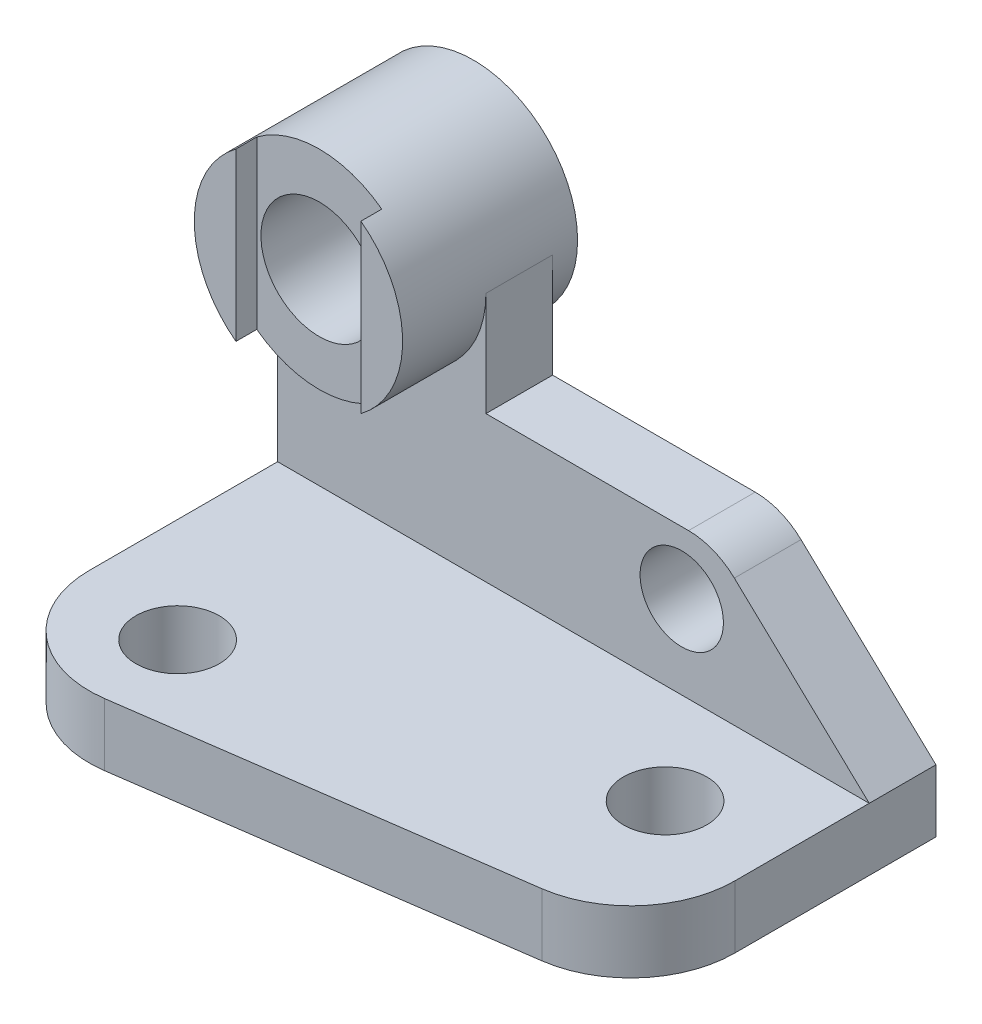
ISO-10303-21;
HEADER;
FILE_DESCRIPTION(('STEP AP214'),'2;1');
FILE_NAME('part.step','',(''),(''),'','','');
FILE_SCHEMA(('AUTOMOTIVE_DESIGN { 1 0 10303 214 1 1 1 1 }'));
ENDSEC;
DATA;
#1=APPLICATION_CONTEXT('core data for automotive mechanical design processes');
#2=APPLICATION_PROTOCOL_DEFINITION('international standard','automotive_design',2000,#1);
#3=PRODUCT_CONTEXT('',#1,'mechanical');
#4=PRODUCT('Part','Part','',(#3));
#5=PRODUCT_RELATED_PRODUCT_CATEGORY('part','',(#4));
#6=PRODUCT_DEFINITION_FORMATION('','',#4);
#7=PRODUCT_DEFINITION_CONTEXT('part definition',#1,'design');
#8=PRODUCT_DEFINITION('design','',#6,#7);
#9=PRODUCT_DEFINITION_SHAPE('','',#8);
#10=(LENGTH_UNIT() NAMED_UNIT(*) SI_UNIT(.MILLI.,.METRE.));
#11=(NAMED_UNIT(*) PLANE_ANGLE_UNIT() SI_UNIT($,.RADIAN.));
#12=(NAMED_UNIT(*) SI_UNIT($,.STERADIAN.) SOLID_ANGLE_UNIT());
#13=UNCERTAINTY_MEASURE_WITH_UNIT(LENGTH_MEASURE(1.E-05),#10,'distance_accuracy_value','');
#14=(GEOMETRIC_REPRESENTATION_CONTEXT(3) GLOBAL_UNCERTAINTY_ASSIGNED_CONTEXT((#13)) GLOBAL_UNIT_ASSIGNED_CONTEXT((#10,
#11,#12)) REPRESENTATION_CONTEXT('',''));
#15=CARTESIAN_POINT('',(0.,0.,0.));
#16=DIRECTION('',(0.,0.,1.));
#17=DIRECTION('',(1.,0.,0.));
#18=AXIS2_PLACEMENT_3D('',#15,#16,#17);
#19=CARTESIAN_POINT('',(0.,0.,-30.2957443941805));
#20=DIRECTION('',(0.,0.,1.));
#21=DIRECTION('',(1.,0.,0.));
#22=AXIS2_PLACEMENT_3D('',#19,#20,#21);
#23=PLANE('',#22);
#24=CARTESIAN_POINT('',(-35.1278678781771,75.,-30.2957443941804));
#25=DIRECTION('',(0.,0.,1.));
#26=DIRECTION('',(1.,0.,0.));
#27=AXIS2_PLACEMENT_3D('',#24,#25,#26);
#28=CIRCLE('',#27,25.);
#29=CARTESIAN_POINT('',(-50.1278678781771,95.,-30.2957443941804));
#30=VERTEX_POINT('',#29);
#31=CARTESIAN_POINT('',(-50.1278678781771,55.,-30.2957443941805));
#32=VERTEX_POINT('',#31);
#33=EDGE_CURVE('E175',#30,#32,#28,.T.);
#34=ORIENTED_EDGE('',*,*,#33,.T.);
#35=DIRECTION('',(0.,-1.,0.));
#36=VECTOR('',#35,1.);
#37=CARTESIAN_POINT('',(-50.1278678781771,95.,-30.2957443941805));
#38=LINE('',#37,#36);
#39=EDGE_CURVE('E168',#30,#32,#38,.T.);
#40=ORIENTED_EDGE('',*,*,#39,.F.);
#41=EDGE_LOOP('',(#34,#40));
#42=FACE_BOUND('',#41,.T.);
#43=ADVANCED_FACE('F40',(#42),#23,.T.);
#44=CARTESIAN_POINT('',(0.,15.,0.));
#45=DIRECTION('',(0.,1.,0.));
#46=DIRECTION('',(0.,0.,1.));
#47=AXIS2_PLACEMENT_3D('',#44,#45,#46);
#48=PLANE('',#47);
#49=CARTESIAN_POINT('',(-35.1278678781771,15.,-1.29574439418016));
#50=DIRECTION('',(0.,1.,0.));
#51=DIRECTION('',(0.,0.,1.));
#52=AXIS2_PLACEMENT_3D('',#49,#50,#51);
#53=CIRCLE('',#52,10.);
#54=CARTESIAN_POINT('',(-35.1278678781771,15.,8.70425560581984));
#55=VERTEX_POINT('',#54);
#56=EDGE_CURVE('E389',#55,#55,#53,.T.);
#57=ORIENTED_EDGE('',*,*,#56,.F.);
#58=EDGE_LOOP('',(#57));
#59=FACE_BOUND('',#58,.T.);
#60=CARTESIAN_POINT('',(56.8721321218229,15.,-26.2957443941802));
#61=DIRECTION('',(0.,1.,0.));
#62=DIRECTION('',(0.,0.,1.));
#63=AXIS2_PLACEMENT_3D('',#60,#61,#62);
#64=CIRCLE('',#63,10.);
#65=CARTESIAN_POINT('',(56.8721321218229,15.,-16.2957443941802));
#66=VERTEX_POINT('',#65);
#67=EDGE_CURVE('E465',#66,#66,#64,.T.);
#68=ORIENTED_EDGE('',*,*,#67,.F.);
#69=EDGE_LOOP('',(#68));
#70=FACE_BOUND('',#69,.T.);
#71=DIRECTION('',(0.,0.,-1.));
#72=VECTOR('',#71,1.);
#73=CARTESIAN_POINT('',(81.8721321218229,15.,-66.2957443941802));
#74=LINE('',#73,#72);
#75=CARTESIAN_POINT('',(81.8721321218229,15.,-18.0213666057905));
#76=VERTEX_POINT('',#75);
#77=CARTESIAN_POINT('',(81.8721321218229,15.,-50.2957443941802));
#78=VERTEX_POINT('',#77);
#79=EDGE_CURVE('E373',#76,#78,#74,.T.);
#80=ORIENTED_EDGE('',*,*,#79,.T.);
#81=DIRECTION('',(-1.,0.,0.));
#82=VECTOR('',#81,1.);
#83=CARTESIAN_POINT('',(-60.1278678781771,15.,-50.2957443941802));
#84=LINE('',#83,#82);
#85=CARTESIAN_POINT('',(-60.1278678781771,15.,-50.2957443941802));
#86=VERTEX_POINT('',#85);
#87=EDGE_CURVE('E418',#78,#86,#84,.T.);
#88=ORIENTED_EDGE('',*,*,#87,.T.);
#89=DIRECTION('',(0.,0.,1.));
#90=VECTOR('',#89,1.);
#91=CARTESIAN_POINT('',(-60.1278678781771,15.,-66.2957443941802));
#92=LINE('',#91,#90);
#93=CARTESIAN_POINT('',(-60.1278678781771,15.,-5.06362012691729));
#94=VERTEX_POINT('',#93);
#95=EDGE_CURVE('E379',#86,#94,#92,.T.);
#96=ORIENTED_EDGE('',*,*,#95,.T.);
#97=CARTESIAN_POINT('',(-35.1278678781771,15.,-5.06362012691728));
#98=DIRECTION('',(0.,1.,0.));
#99=DIRECTION('',(0.,0.,1.));
#100=AXIS2_PLACEMENT_3D('',#97,#98,#99);
#101=CIRCLE('',#100,25.);
#102=CARTESIAN_POINT('',(-31.6411548320298,15.,19.6920425007287));
#103=VERTEX_POINT('',#102);
#104=EDGE_CURVE('E358',#94,#103,#101,.T.);
#105=ORIENTED_EDGE('',*,*,#104,.T.);
#106=DIRECTION('',(0.990226505105838,0.,-0.139468521845893));
#107=VECTOR('',#106,1.);
#108=CARTESIAN_POINT('',(-60.1278678781771,15.,23.7042556058198));
#109=LINE('',#108,#107);
#110=CARTESIAN_POINT('',(60.3588451679702,15.,6.73429602185544));
#111=VERTEX_POINT('',#110);
#112=EDGE_CURVE('E378',#103,#111,#109,.T.);
#113=ORIENTED_EDGE('',*,*,#112,.T.);
#114=CARTESIAN_POINT('',(56.8721321218229,15.,-18.0213666057905));
#115=DIRECTION('',(0.,1.,0.));
#116=DIRECTION('',(0.,0.,1.));
#117=AXIS2_PLACEMENT_3D('',#114,#115,#116);
#118=CIRCLE('',#117,25.);
#119=EDGE_CURVE('E365',#111,#76,#118,.T.);
#120=ORIENTED_EDGE('',*,*,#119,.T.);
#121=EDGE_LOOP('',(#80,#88,#96,#105,#113,#120));
#122=FACE_BOUND('',#121,.T.);
#123=ADVANCED_FACE('F276',(#59,#70,#122),#48,.T.);
#124=CARTESIAN_POINT('',(0.,0.,0.));
#125=DIRECTION('',(0.,1.,0.));
#126=DIRECTION('',(0.,0.,1.));
#127=AXIS2_PLACEMENT_3D('',#124,#125,#126);
#128=PLANE('',#127);
#129=DIRECTION('',(0.,0.,-1.));
#130=VECTOR('',#129,1.);
#131=CARTESIAN_POINT('',(81.8721321218229,0.,-66.2957443941802));
#132=LINE('',#131,#130);
#133=CARTESIAN_POINT('',(81.8721321218229,0.,-18.0213666057905));
#134=VERTEX_POINT('',#133);
#135=CARTESIAN_POINT('',(81.8721321218229,0.,-66.2957443941802));
#136=VERTEX_POINT('',#135);
#137=EDGE_CURVE('E392',#134,#136,#132,.T.);
#138=ORIENTED_EDGE('',*,*,#137,.F.);
#139=CARTESIAN_POINT('',(56.8721321218229,0.,-18.0213666057905));
#140=DIRECTION('',(0.,1.,0.));
#141=DIRECTION('',(0.,0.,1.));
#142=AXIS2_PLACEMENT_3D('',#139,#140,#141);
#143=CIRCLE('',#142,25.);
#144=CARTESIAN_POINT('',(60.3588451679702,0.,6.73429602185544));
#145=VERTEX_POINT('',#144);
#146=EDGE_CURVE('E402',#134,#145,#143,.F.);
#147=ORIENTED_EDGE('',*,*,#146,.T.);
#148=DIRECTION('',(0.990226505105838,0.,-0.139468521845893));
#149=VECTOR('',#148,1.);
#150=CARTESIAN_POINT('',(-60.1278678781771,0.,23.7042556058198));
#151=LINE('',#150,#149);
#152=CARTESIAN_POINT('',(-31.6411548320298,0.,19.6920425007287));
#153=VERTEX_POINT('',#152);
#154=EDGE_CURVE('E388',#153,#145,#151,.T.);
#155=ORIENTED_EDGE('',*,*,#154,.F.);
#156=CARTESIAN_POINT('',(-35.1278678781771,0.,-5.06362012691728));
#157=DIRECTION('',(0.,1.,0.));
#158=DIRECTION('',(0.,0.,1.));
#159=AXIS2_PLACEMENT_3D('',#156,#157,#158);
#160=CIRCLE('',#159,25.);
#161=CARTESIAN_POINT('',(-60.1278678781771,0.,-5.06362012691729));
#162=VERTEX_POINT('',#161);
#163=EDGE_CURVE('E399',#153,#162,#160,.F.);
#164=ORIENTED_EDGE('',*,*,#163,.T.);
#165=DIRECTION('',(0.,0.,1.));
#166=VECTOR('',#165,1.);
#167=CARTESIAN_POINT('',(-60.1278678781771,0.,-66.2957443941802));
#168=LINE('',#167,#166);
#169=CARTESIAN_POINT('',(-60.1278678781771,0.,-66.2957443941802));
#170=VERTEX_POINT('',#169);
#171=EDGE_CURVE('E385',#170,#162,#168,.T.);
#172=ORIENTED_EDGE('',*,*,#171,.F.);
#173=DIRECTION('',(-1.,0.,0.));
#174=VECTOR('',#173,1.);
#175=CARTESIAN_POINT('',(-60.1278678781771,0.,-66.2957443941802));
#176=LINE('',#175,#174);
#177=EDGE_CURVE('E394',#136,#170,#176,.T.);
#178=ORIENTED_EDGE('',*,*,#177,.F.);
#179=EDGE_LOOP('',(#138,#147,#155,#164,#172,#178));
#180=FACE_BOUND('',#179,.T.);
#181=CARTESIAN_POINT('',(-35.1278678781771,0.,-1.29574439418016));
#182=DIRECTION('',(0.,1.,0.));
#183=DIRECTION('',(0.,0.,1.));
#184=AXIS2_PLACEMENT_3D('',#181,#182,#183);
#185=CIRCLE('',#184,10.);
#186=CARTESIAN_POINT('',(-35.1278678781771,0.,8.70425560581984));
#187=VERTEX_POINT('',#186);
#188=EDGE_CURVE('E468',#187,#187,#185,.T.);
#189=ORIENTED_EDGE('',*,*,#188,.T.);
#190=EDGE_LOOP('',(#189));
#191=FACE_BOUND('',#190,.T.);
#192=CARTESIAN_POINT('',(56.8721321218229,0.,-26.2957443941802));
#193=DIRECTION('',(0.,1.,0.));
#194=DIRECTION('',(0.,0.,1.));
#195=AXIS2_PLACEMENT_3D('',#192,#193,#194);
#196=CIRCLE('',#195,10.);
#197=CARTESIAN_POINT('',(56.8721321218229,0.,-16.2957443941802));
#198=VERTEX_POINT('',#197);
#199=EDGE_CURVE('E239',#198,#198,#196,.T.);
#200=ORIENTED_EDGE('',*,*,#199,.T.);
#201=EDGE_LOOP('',(#200));
#202=FACE_BOUND('',#201,.T.);
#203=ADVANCED_FACE('F281',(#180,#191,#202),#128,.F.);
#204=CARTESIAN_POINT('',(-60.1278678781771,15.,-66.2957443941802));
#205=DIRECTION('',(1.,0.,0.));
#206=DIRECTION('',(0.,0.,-1.));
#207=AXIS2_PLACEMENT_3D('',#204,#205,#206);
#208=PLANE('',#207);
#209=ORIENTED_EDGE('',*,*,#171,.T.);
#210=DIRECTION('',(0.,-1.,0.));
#211=VECTOR('',#210,1.);
#212=CARTESIAN_POINT('',(-60.1278678781771,15.,-5.06362012691728));
#213=LINE('',#212,#211);
#214=EDGE_CURVE('E247',#162,#94,#213,.F.);
#215=ORIENTED_EDGE('',*,*,#214,.T.);
#216=ORIENTED_EDGE('',*,*,#95,.F.);
#217=DIRECTION('',(0.,1.,0.));
#218=VECTOR('',#217,1.);
#219=CARTESIAN_POINT('',(-60.1278678781771,15.,-50.2957443941802));
#220=LINE('',#219,#218);
#221=CARTESIAN_POINT('',(-60.1278678781771,75.,-50.2957443941804));
#222=VERTEX_POINT('',#221);
#223=EDGE_CURVE('E434',#86,#222,#220,.T.);
#224=ORIENTED_EDGE('',*,*,#223,.T.);
#225=DIRECTION('',(0.,0.,1.));
#226=VECTOR('',#225,1.);
#227=CARTESIAN_POINT('',(-60.1278678781771,75.,-66.2957443941802));
#228=LINE('',#227,#226);
#229=CARTESIAN_POINT('',(-60.1278678781771,75.,-66.2957443941802));
#230=VERTEX_POINT('',#229);
#231=EDGE_CURVE('E436',#230,#222,#228,.T.);
#232=ORIENTED_EDGE('',*,*,#231,.F.);
#233=DIRECTION('',(0.,-1.,0.));
#234=VECTOR('',#233,1.);
#235=CARTESIAN_POINT('',(-60.1278678781771,15.,-66.2957443941802));
#236=LINE('',#235,#234);
#237=EDGE_CURVE('E377',#230,#170,#236,.T.);
#238=ORIENTED_EDGE('',*,*,#237,.T.);
#239=EDGE_LOOP('',(#209,#215,#216,#224,#232,#238));
#240=FACE_BOUND('',#239,.T.);
#241=ADVANCED_FACE('F333',(#240),#208,.F.);
#242=CARTESIAN_POINT('',(-60.1278678781771,15.,23.7042556058198));
#243=DIRECTION('',(-0.139468521845893,0.,-0.990226505105838));
#244=DIRECTION('',(-0.990226505105838,0.,0.139468521845893));
#245=AXIS2_PLACEMENT_3D('',#242,#243,#244);
#246=PLANE('',#245);
#247=ORIENTED_EDGE('',*,*,#154,.T.);
#248=DIRECTION('',(0.,-1.,0.));
#249=VECTOR('',#248,1.);
#250=CARTESIAN_POINT('',(60.3588451679702,15.,6.73429602185543));
#251=LINE('',#250,#249);
#252=EDGE_CURVE('E366',#145,#111,#251,.F.);
#253=ORIENTED_EDGE('',*,*,#252,.T.);
#254=ORIENTED_EDGE('',*,*,#112,.F.);
#255=DIRECTION('',(0.,-1.,0.));
#256=VECTOR('',#255,1.);
#257=CARTESIAN_POINT('',(-31.6411548320298,15.,19.6920425007287));
#258=LINE('',#257,#256);
#259=EDGE_CURVE('E361',#103,#153,#258,.T.);
#260=ORIENTED_EDGE('',*,*,#259,.T.);
#261=EDGE_LOOP('',(#247,#253,#254,#260));
#262=FACE_BOUND('',#261,.T.);
#263=ADVANCED_FACE('F341',(#262),#246,.F.);
#264=CARTESIAN_POINT('',(81.8721321218229,15.,-66.2957443941802));
#265=DIRECTION('',(-1.,0.,0.));
#266=DIRECTION('',(0.,0.,1.));
#267=AXIS2_PLACEMENT_3D('',#264,#265,#266);
#268=PLANE('',#267);
#269=ORIENTED_EDGE('',*,*,#79,.F.);
#270=DIRECTION('',(0.,-1.,0.));
#271=VECTOR('',#270,1.);
#272=CARTESIAN_POINT('',(81.8721321218229,15.,-18.0213666057905));
#273=LINE('',#272,#271);
#274=EDGE_CURVE('E396',#76,#134,#273,.T.);
#275=ORIENTED_EDGE('',*,*,#274,.T.);
#276=ORIENTED_EDGE('',*,*,#137,.T.);
#277=DIRECTION('',(0.,-1.,0.));
#278=VECTOR('',#277,1.);
#279=CARTESIAN_POINT('',(81.8721321218229,15.,-66.2957443941802));
#280=LINE('',#279,#278);
#281=CARTESIAN_POINT('',(81.8721321218229,15.,-66.2957443941802));
#282=VERTEX_POINT('',#281);
#283=EDGE_CURVE('E400',#282,#136,#280,.T.);
#284=ORIENTED_EDGE('',*,*,#283,.F.);
#285=DIRECTION('',(0.,0.,1.));
#286=VECTOR('',#285,1.);
#287=CARTESIAN_POINT('',(81.8721321218229,15.,-66.2957443941802));
#288=LINE('',#287,#286);
#289=EDGE_CURVE('E233',#282,#78,#288,.T.);
#290=ORIENTED_EDGE('',*,*,#289,.T.);
#291=EDGE_LOOP('',(#269,#275,#276,#284,#290));
#292=FACE_BOUND('',#291,.T.);
#293=ADVANCED_FACE('F337',(#292),#268,.F.);
#294=CARTESIAN_POINT('',(-60.1278678781771,15.,-66.2957443941802));
#295=DIRECTION('',(0.,0.,1.));
#296=DIRECTION('',(1.,0.,0.));
#297=AXIS2_PLACEMENT_3D('',#294,#295,#296);
#298=PLANE('',#297);
#299=CARTESIAN_POINT('',(-35.1278678781771,75.,-66.2957443941802));
#300=DIRECTION('',(0.,0.,1.));
#301=DIRECTION('',(1.,0.,0.));
#302=AXIS2_PLACEMENT_3D('',#299,#300,#301);
#303=CIRCLE('',#302,25.);
#304=CARTESIAN_POINT('',(-10.1278678781771,75.,-66.2957443941802));
#305=VERTEX_POINT('',#304);
#306=EDGE_CURVE('E212',#305,#230,#303,.F.);
#307=ORIENTED_EDGE('',*,*,#306,.F.);
#308=DIRECTION('',(0.,-1.,0.));
#309=VECTOR('',#308,1.);
#310=CARTESIAN_POINT('',(-10.1278678781771,75.,-66.2957443941802));
#311=LINE('',#310,#309);
#312=CARTESIAN_POINT('',(-10.1278678781771,50.,-66.2957443941802));
#313=VERTEX_POINT('',#312);
#314=EDGE_CURVE('E446',#305,#313,#311,.T.);
#315=ORIENTED_EDGE('',*,*,#314,.T.);
#316=DIRECTION('',(1.,0.,0.));
#317=VECTOR('',#316,1.);
#318=CARTESIAN_POINT('',(-10.1278678781771,50.,-66.2957443941802));
#319=LINE('',#318,#317);
#320=CARTESIAN_POINT('',(38.5035258073144,50.,-66.2957443941802));
#321=VERTEX_POINT('',#320);
#322=EDGE_CURVE('E225',#313,#321,#319,.T.);
#323=ORIENTED_EDGE('',*,*,#322,.T.);
#324=CARTESIAN_POINT('',(38.5035258073144,34.,-66.2957443941802));
#325=DIRECTION('',(0.,0.,1.));
#326=DIRECTION('',(1.,0.,0.));
#327=AXIS2_PLACEMENT_3D('',#324,#325,#326);
#328=CIRCLE('',#327,16.);
#329=CARTESIAN_POINT('',(49.4987234693317,45.6234946712754,-66.2957443941802));
#330=VERTEX_POINT('',#329);
#331=EDGE_CURVE('E12',#321,#330,#328,.F.);
#332=ORIENTED_EDGE('',*,*,#331,.T.);
#333=DIRECTION('',(0.726468416954716,-0.687199853876083,0.));
#334=VECTOR('',#333,1.);
#335=CARTESIAN_POINT('',(44.8721321218229,50.,-66.2957443941802));
#336=LINE('',#335,#334);
#337=EDGE_CURVE('E236',#330,#282,#336,.T.);
#338=ORIENTED_EDGE('',*,*,#337,.T.);
#339=ORIENTED_EDGE('',*,*,#283,.T.);
#340=ORIENTED_EDGE('',*,*,#177,.T.);
#341=ORIENTED_EDGE('',*,*,#237,.F.);
#342=EDGE_LOOP('',(#307,#315,#323,#332,#338,#339,#340,#341));
#343=FACE_BOUND('',#342,.T.);
#344=CARTESIAN_POINT('',(36.8721321218229,35.,-66.2957443941802));
#345=DIRECTION('',(0.,0.,1.));
#346=DIRECTION('',(1.,0.,0.));
#347=AXIS2_PLACEMENT_3D('',#344,#345,#346);
#348=CIRCLE('',#347,10.);
#349=CARTESIAN_POINT('',(46.8721321218229,35.,-66.2957443941802));
#350=VERTEX_POINT('',#349);
#351=EDGE_CURVE('E216',#350,#350,#348,.T.);
#352=ORIENTED_EDGE('',*,*,#351,.T.);
#353=EDGE_LOOP('',(#352));
#354=FACE_BOUND('',#353,.T.);
#355=ADVANCED_FACE('F328',(#343,#354),#298,.F.);
#356=CARTESIAN_POINT('',(-35.1278678781771,15.,-1.29574439418016));
#357=DIRECTION('',(0.,-1.,0.));
#358=DIRECTION('',(0.,0.,-1.));
#359=AXIS2_PLACEMENT_3D('',#356,#357,#358);
#360=CYLINDRICAL_SURFACE('',#359,10.);
#361=ORIENTED_EDGE('',*,*,#56,.T.);
#362=EDGE_LOOP('',(#361));
#363=FACE_BOUND('',#362,.T.);
#364=ORIENTED_EDGE('',*,*,#188,.F.);
#365=EDGE_LOOP('',(#364));
#366=FACE_BOUND('',#365,.T.);
#367=ADVANCED_FACE('F325',(#363,#366),#360,.F.);
#368=CARTESIAN_POINT('',(56.8721321218229,15.,-26.2957443941802));
#369=DIRECTION('',(0.,-1.,0.));
#370=DIRECTION('',(0.,0.,-1.));
#371=AXIS2_PLACEMENT_3D('',#368,#369,#370);
#372=CYLINDRICAL_SURFACE('',#371,10.);
#373=ORIENTED_EDGE('',*,*,#67,.T.);
#374=EDGE_LOOP('',(#373));
#375=FACE_BOUND('',#374,.T.);
#376=ORIENTED_EDGE('',*,*,#199,.F.);
#377=EDGE_LOOP('',(#376));
#378=FACE_BOUND('',#377,.T.);
#379=ADVANCED_FACE('F321',(#375,#378),#372,.F.);
#380=CARTESIAN_POINT('',(56.8721321218229,15.,-18.0213666057905));
#381=DIRECTION('',(0.,-1.,0.));
#382=DIRECTION('',(0.,0.,-1.));
#383=AXIS2_PLACEMENT_3D('',#380,#381,#382);
#384=CYLINDRICAL_SURFACE('',#383,25.);
#385=ORIENTED_EDGE('',*,*,#119,.F.);
#386=ORIENTED_EDGE('',*,*,#252,.F.);
#387=ORIENTED_EDGE('',*,*,#146,.F.);
#388=ORIENTED_EDGE('',*,*,#274,.F.);
#389=EDGE_LOOP('',(#385,#386,#387,#388));
#390=FACE_BOUND('',#389,.T.);
#391=ADVANCED_FACE('F324',(#390),#384,.T.);
#392=CARTESIAN_POINT('',(-35.1278678781771,15.,-5.06362012691728));
#393=DIRECTION('',(0.,-1.,0.));
#394=DIRECTION('',(0.,0.,-1.));
#395=AXIS2_PLACEMENT_3D('',#392,#393,#394);
#396=CYLINDRICAL_SURFACE('',#395,25.);
#397=ORIENTED_EDGE('',*,*,#104,.F.);
#398=ORIENTED_EDGE('',*,*,#214,.F.);
#399=ORIENTED_EDGE('',*,*,#163,.F.);
#400=ORIENTED_EDGE('',*,*,#259,.F.);
#401=EDGE_LOOP('',(#397,#398,#399,#400));
#402=FACE_BOUND('',#401,.T.);
#403=ADVANCED_FACE('F317',(#402),#396,.T.);
#404=CARTESIAN_POINT('',(0.,0.,-50.2957443941804));
#405=DIRECTION('',(0.,0.,-1.));
#406=DIRECTION('',(-1.,0.,0.));
#407=AXIS2_PLACEMENT_3D('',#404,#405,#406);
#408=PLANE('',#407);
#409=CARTESIAN_POINT('',(-35.1278678781771,75.,-50.2957443941804));
#410=DIRECTION('',(0.,0.,-1.));
#411=DIRECTION('',(-1.,0.,0.));
#412=AXIS2_PLACEMENT_3D('',#409,#410,#411);
#413=CIRCLE('',#412,25.);
#414=CARTESIAN_POINT('',(-10.1278678781771,75.,-50.2957443941802));
#415=VERTEX_POINT('',#414);
#416=EDGE_CURVE('E210',#222,#415,#413,.F.);
#417=ORIENTED_EDGE('',*,*,#416,.F.);
#418=ORIENTED_EDGE('',*,*,#223,.F.);
#419=ORIENTED_EDGE('',*,*,#87,.F.);
#420=DIRECTION('',(0.726468416954716,-0.687199853876083,0.));
#421=VECTOR('',#420,1.);
#422=CARTESIAN_POINT('',(44.8721321218229,50.,-50.2957443941802));
#423=LINE('',#422,#421);
#424=CARTESIAN_POINT('',(49.4987234693317,45.6234946712754,-50.2957443941802));
#425=VERTEX_POINT('',#424);
#426=EDGE_CURVE('E240',#425,#78,#423,.T.);
#427=ORIENTED_EDGE('',*,*,#426,.F.);
#428=CARTESIAN_POINT('',(38.5035258073144,34.,-50.2957443941804));
#429=DIRECTION('',(0.,0.,-1.));
#430=DIRECTION('',(-1.,0.,0.));
#431=AXIS2_PLACEMENT_3D('',#428,#429,#430);
#432=CIRCLE('',#431,16.);
#433=CARTESIAN_POINT('',(38.5035258073144,50.,-50.2957443941802));
#434=VERTEX_POINT('',#433);
#435=EDGE_CURVE('E246',#425,#434,#432,.F.);
#436=ORIENTED_EDGE('',*,*,#435,.T.);
#437=DIRECTION('',(1.,0.,0.));
#438=VECTOR('',#437,1.);
#439=CARTESIAN_POINT('',(-10.1278678781771,50.,-50.2957443941802));
#440=LINE('',#439,#438);
#441=CARTESIAN_POINT('',(-10.1278678781771,50.,-50.2957443941802));
#442=VERTEX_POINT('',#441);
#443=EDGE_CURVE('E224',#442,#434,#440,.T.);
#444=ORIENTED_EDGE('',*,*,#443,.F.);
#445=DIRECTION('',(0.,-1.,0.));
#446=VECTOR('',#445,1.);
#447=CARTESIAN_POINT('',(-10.1278678781771,75.,-50.2957443941802));
#448=LINE('',#447,#446);
#449=EDGE_CURVE('E227',#415,#442,#448,.T.);
#450=ORIENTED_EDGE('',*,*,#449,.F.);
#451=EDGE_LOOP('',(#417,#418,#419,#427,#436,#444,#450));
#452=FACE_BOUND('',#451,.T.);
#453=CARTESIAN_POINT('',(36.8721321218229,35.,-50.2957443941802));
#454=DIRECTION('',(0.,0.,1.));
#455=DIRECTION('',(1.,0.,0.));
#456=AXIS2_PLACEMENT_3D('',#453,#454,#455);
#457=CIRCLE('',#456,10.);
#458=CARTESIAN_POINT('',(46.8721321218229,35.,-50.2957443941802));
#459=VERTEX_POINT('',#458);
#460=EDGE_CURVE('E221',#459,#459,#457,.T.);
#461=ORIENTED_EDGE('',*,*,#460,.F.);
#462=EDGE_LOOP('',(#461));
#463=FACE_BOUND('',#462,.T.);
#464=ADVANCED_FACE('F306',(#452,#463),#408,.F.);
#465=CARTESIAN_POINT('',(-10.1278678781771,50.,-66.2957443941802));
#466=DIRECTION('',(0.,-1.,0.));
#467=DIRECTION('',(0.,0.,-1.));
#468=AXIS2_PLACEMENT_3D('',#465,#466,#467);
#469=PLANE('',#468);
#470=ORIENTED_EDGE('',*,*,#443,.T.);
#471=DIRECTION('',(0.,0.,1.));
#472=VECTOR('',#471,1.);
#473=CARTESIAN_POINT('',(38.5035258073144,50.,-66.2957443941802));
#474=LINE('',#473,#472);
#475=EDGE_CURVE('E50',#434,#321,#474,.F.);
#476=ORIENTED_EDGE('',*,*,#475,.T.);
#477=ORIENTED_EDGE('',*,*,#322,.F.);
#478=DIRECTION('',(0.,0.,1.));
#479=VECTOR('',#478,1.);
#480=CARTESIAN_POINT('',(-10.1278678781771,50.,-66.2957443941802));
#481=LINE('',#480,#479);
#482=EDGE_CURVE('E228',#313,#442,#481,.T.);
#483=ORIENTED_EDGE('',*,*,#482,.T.);
#484=EDGE_LOOP('',(#470,#476,#477,#483));
#485=FACE_BOUND('',#484,.T.);
#486=ADVANCED_FACE('F307',(#485),#469,.F.);
#487=CARTESIAN_POINT('',(-10.1278678781771,75.,-66.2957443941802));
#488=DIRECTION('',(-1.,0.,0.));
#489=DIRECTION('',(0.,-1.,0.));
#490=AXIS2_PLACEMENT_3D('',#487,#488,#489);
#491=PLANE('',#490);
#492=ORIENTED_EDGE('',*,*,#449,.T.);
#493=ORIENTED_EDGE('',*,*,#482,.F.);
#494=ORIENTED_EDGE('',*,*,#314,.F.);
#495=DIRECTION('',(0.,0.,1.));
#496=VECTOR('',#495,1.);
#497=CARTESIAN_POINT('',(-10.1278678781771,75.,-66.2957443941802));
#498=LINE('',#497,#496);
#499=EDGE_CURVE('E449',#305,#415,#498,.T.);
#500=ORIENTED_EDGE('',*,*,#499,.T.);
#501=EDGE_LOOP('',(#492,#493,#494,#500));
#502=FACE_BOUND('',#501,.T.);
#503=ADVANCED_FACE('F310',(#502),#491,.F.);
#504=CARTESIAN_POINT('',(44.8721321218229,50.,-66.2957443941802));
#505=DIRECTION('',(-0.687199853876083,-0.726468416954716,0.));
#506=DIRECTION('',(0.726468416954716,-0.687199853876083,0.));
#507=AXIS2_PLACEMENT_3D('',#504,#505,#506);
#508=PLANE('',#507);
#509=ORIENTED_EDGE('',*,*,#337,.F.);
#510=DIRECTION('',(0.,0.,1.));
#511=VECTOR('',#510,1.);
#512=CARTESIAN_POINT('',(49.4987234693317,45.6234946712754,-66.2957443941802));
#513=LINE('',#512,#511);
#514=EDGE_CURVE('E243',#330,#425,#513,.T.);
#515=ORIENTED_EDGE('',*,*,#514,.T.);
#516=ORIENTED_EDGE('',*,*,#426,.T.);
#517=ORIENTED_EDGE('',*,*,#289,.F.);
#518=EDGE_LOOP('',(#509,#515,#516,#517));
#519=FACE_BOUND('',#518,.T.);
#520=ADVANCED_FACE('F304',(#519),#508,.F.);
#521=CARTESIAN_POINT('',(36.8721321218229,35.,-66.2957443941802));
#522=DIRECTION('',(0.,0.,1.));
#523=DIRECTION('',(1.,0.,0.));
#524=AXIS2_PLACEMENT_3D('',#521,#522,#523);
#525=CYLINDRICAL_SURFACE('',#524,10.);
#526=ORIENTED_EDGE('',*,*,#351,.F.);
#527=EDGE_LOOP('',(#526));
#528=FACE_BOUND('',#527,.T.);
#529=ORIENTED_EDGE('',*,*,#460,.T.);
#530=EDGE_LOOP('',(#529));
#531=FACE_BOUND('',#530,.T.);
#532=ADVANCED_FACE('F301',(#528,#531),#525,.F.);
#533=CARTESIAN_POINT('',(38.5035258073144,34.,-66.2957443941802));
#534=DIRECTION('',(0.,0.,1.));
#535=DIRECTION('',(1.,0.,0.));
#536=AXIS2_PLACEMENT_3D('',#533,#534,#535);
#537=CYLINDRICAL_SURFACE('',#536,16.);
#538=ORIENTED_EDGE('',*,*,#331,.F.);
#539=ORIENTED_EDGE('',*,*,#475,.F.);
#540=ORIENTED_EDGE('',*,*,#435,.F.);
#541=ORIENTED_EDGE('',*,*,#514,.F.);
#542=EDGE_LOOP('',(#538,#539,#540,#541));
#543=FACE_BOUND('',#542,.T.);
#544=ADVANCED_FACE('F42',(#543),#537,.T.);
#545=CARTESIAN_POINT('',(-35.1278678781771,75.,-58.2957443941804));
#546=DIRECTION('',(0.,0.,-1.));
#547=DIRECTION('',(-1.,0.,0.));
#548=AXIS2_PLACEMENT_3D('',#545,#546,#547);
#549=CYLINDRICAL_SURFACE('',#548,25.);
#550=CARTESIAN_POINT('',(-35.1278678781771,75.,-72.2957443941804));
#551=DIRECTION('',(0.,0.,1.));
#552=DIRECTION('',(1.,0.,0.));
#553=AXIS2_PLACEMENT_3D('',#550,#551,#552);
#554=CIRCLE('',#553,25.);
#555=CARTESIAN_POINT('',(-10.1278678781771,75.,-72.2957443941804));
#556=VERTEX_POINT('',#555);
#557=EDGE_CURVE('E207',#556,#556,#554,.T.);
#558=ORIENTED_EDGE('',*,*,#557,.T.);
#559=EDGE_LOOP('',(#558));
#560=FACE_BOUND('',#559,.T.);
#561=CARTESIAN_POINT('',(-20.1278678781771,55.,-30.2957443941805));
#562=VERTEX_POINT('',#561);
#563=CARTESIAN_POINT('',(-20.1278678781771,95.,-30.2957443941805));
#564=VERTEX_POINT('',#563);
#565=EDGE_CURVE('E44',#562,#564,#28,.T.);
#566=ORIENTED_EDGE('',*,*,#565,.F.);
#567=DIRECTION('',(0.,0.,-1.));
#568=VECTOR('',#567,1.);
#569=CARTESIAN_POINT('',(-20.1278678781771,55.,-30.2957443941805));
#570=LINE('',#569,#568);
#571=CARTESIAN_POINT('',(-20.1278678781771,55.,-35.2957443941805));
#572=VERTEX_POINT('',#571);
#573=EDGE_CURVE('E196',#562,#572,#570,.T.);
#574=ORIENTED_EDGE('',*,*,#573,.T.);
#575=CARTESIAN_POINT('',(-35.1278678781771,75.,-35.2957443941805));
#576=DIRECTION('',(0.,0.,1.));
#577=DIRECTION('',(1.,0.,0.));
#578=AXIS2_PLACEMENT_3D('',#575,#576,#577);
#579=CIRCLE('',#578,25.);
#580=CARTESIAN_POINT('',(-50.1278678781771,55.,-35.2957443941805));
#581=VERTEX_POINT('',#580);
#582=EDGE_CURVE('E192',#581,#572,#579,.T.);
#583=ORIENTED_EDGE('',*,*,#582,.F.);
#584=DIRECTION('',(0.,0.,-1.));
#585=VECTOR('',#584,1.);
#586=CARTESIAN_POINT('',(-50.1278678781771,55.,-30.2957443941805));
#587=LINE('',#586,#585);
#588=EDGE_CURVE('E154',#32,#581,#587,.T.);
#589=ORIENTED_EDGE('',*,*,#588,.F.);
#590=ORIENTED_EDGE('',*,*,#33,.F.);
#591=DIRECTION('',(0.,0.,-1.));
#592=VECTOR('',#591,1.);
#593=CARTESIAN_POINT('',(-50.1278678781771,95.,-30.2957443941805));
#594=LINE('',#593,#592);
#595=CARTESIAN_POINT('',(-50.1278678781771,95.,-35.2957443941805));
#596=VERTEX_POINT('',#595);
#597=EDGE_CURVE('E58',#30,#596,#594,.T.);
#598=ORIENTED_EDGE('',*,*,#597,.T.);
#599=CARTESIAN_POINT('',(-35.1278678781771,75.,-35.2957443941805));
#600=DIRECTION('',(0.,0.,1.));
#601=DIRECTION('',(1.,0.,0.));
#602=AXIS2_PLACEMENT_3D('',#599,#600,#601);
#603=CIRCLE('',#602,25.);
#604=CARTESIAN_POINT('',(-20.1278678781771,95.,-35.2957443941805));
#605=VERTEX_POINT('',#604);
#606=EDGE_CURVE('E161',#605,#596,#603,.T.);
#607=ORIENTED_EDGE('',*,*,#606,.F.);
#608=DIRECTION('',(0.,0.,-1.));
#609=VECTOR('',#608,1.);
#610=CARTESIAN_POINT('',(-20.1278678781771,95.,-30.2957443941805));
#611=LINE('',#610,#609);
#612=EDGE_CURVE('E186',#564,#605,#611,.T.);
#613=ORIENTED_EDGE('',*,*,#612,.F.);
#614=EDGE_LOOP('',(#566,#574,#583,#589,#590,#598,#607,#613));
#615=FACE_BOUND('',#614,.T.);
#616=ORIENTED_EDGE('',*,*,#306,.T.);
#617=ORIENTED_EDGE('',*,*,#231,.T.);
#618=ORIENTED_EDGE('',*,*,#416,.T.);
#619=ORIENTED_EDGE('',*,*,#499,.F.);
#620=EDGE_LOOP('',(#616,#617,#618,#619));
#621=FACE_BOUND('',#620,.T.);
#622=ADVANCED_FACE('F172',(#560,#615,#621),#549,.T.);
#623=CARTESIAN_POINT('',(0.,0.,-72.2957443941805));
#624=DIRECTION('',(0.,0.,1.));
#625=DIRECTION('',(1.,0.,0.));
#626=AXIS2_PLACEMENT_3D('',#623,#624,#625);
#627=PLANE('',#626);
#628=CARTESIAN_POINT('',(-35.1278678781771,75.,-72.2957443941805));
#629=DIRECTION('',(0.,0.,1.));
#630=DIRECTION('',(1.,0.,0.));
#631=AXIS2_PLACEMENT_3D('',#628,#629,#630);
#632=CIRCLE('',#631,14.);
#633=CARTESIAN_POINT('',(-21.1278678781771,75.,-72.2957443941805));
#634=VERTEX_POINT('',#633);
#635=EDGE_CURVE('E204',#634,#634,#632,.T.);
#636=ORIENTED_EDGE('',*,*,#635,.T.);
#637=EDGE_LOOP('',(#636));
#638=FACE_BOUND('',#637,.T.);
#639=ORIENTED_EDGE('',*,*,#557,.F.);
#640=EDGE_LOOP('',(#639));
#641=FACE_BOUND('',#640,.T.);
#642=ADVANCED_FACE('F287',(#638,#641),#627,.F.);
#643=DIRECTION('',(0.,-1.,0.));
#644=VECTOR('',#643,1.);
#645=CARTESIAN_POINT('',(-20.1278678781771,95.,-30.2957443941805));
#646=LINE('',#645,#644);
#647=EDGE_CURVE('E201',#564,#562,#646,.T.);
#648=ORIENTED_EDGE('',*,*,#647,.T.);
#649=ORIENTED_EDGE('',*,*,#565,.T.);
#650=EDGE_LOOP('',(#648,#649));
#651=FACE_BOUND('',#650,.T.);
#652=ADVANCED_FACE('F257',(#651),#23,.T.);
#653=CARTESIAN_POINT('',(-35.1278678781771,75.,-86.2957443941805));
#654=DIRECTION('',(0.,0.,1.));
#655=DIRECTION('',(1.,0.,0.));
#656=AXIS2_PLACEMENT_3D('',#653,#654,#655);
#657=CYLINDRICAL_SURFACE('',#656,14.);
#658=CARTESIAN_POINT('',(-35.1278678781771,75.,-35.2957443941774));
#659=DIRECTION('',(0.,-2.49609432874165E-13,-1.));
#660=DIRECTION('',(0.,1.,-2.49609432874165E-13));
#661=AXIS2_PLACEMENT_3D('',#658,#659,#660);
#662=CIRCLE('',#661,14.);
#663=CARTESIAN_POINT('',(-35.1278678781771,89.,-35.2957443941809));
#664=VERTEX_POINT('',#663);
#665=EDGE_CURVE('E167',#664,#664,#662,.F.);
#666=ORIENTED_EDGE('',*,*,#665,.T.);
#667=EDGE_LOOP('',(#666));
#668=FACE_BOUND('',#667,.T.);
#669=ORIENTED_EDGE('',*,*,#635,.F.);
#670=EDGE_LOOP('',(#669));
#671=FACE_BOUND('',#670,.T.);
#672=ADVANCED_FACE('F273',(#668,#671),#657,.F.);
#673=CARTESIAN_POINT('',(-1.22690113112646E-12,-7.56210357672697E-12,-35.2957443941601));
#674=DIRECTION('',(0.,-2.49609432874165E-13,-1.));
#675=DIRECTION('',(0.,1.,-2.49609432874165E-13));
#676=AXIS2_PLACEMENT_3D('',#673,#674,#675);
#677=PLANE('',#676);
#678=ORIENTED_EDGE('',*,*,#606,.T.);
#679=DIRECTION('',(0.,-1.,0.));
#680=VECTOR('',#679,1.);
#681=CARTESIAN_POINT('',(-50.1278678781771,95.,-35.2957443941805));
#682=LINE('',#681,#680);
#683=EDGE_CURVE('E150',#596,#581,#682,.T.);
#684=ORIENTED_EDGE('',*,*,#683,.T.);
#685=ORIENTED_EDGE('',*,*,#582,.T.);
#686=DIRECTION('',(0.,-1.,0.));
#687=VECTOR('',#686,1.);
#688=CARTESIAN_POINT('',(-20.1278678781771,95.,-35.2957443941805));
#689=LINE('',#688,#687);
#690=EDGE_CURVE('E164',#605,#572,#689,.T.);
#691=ORIENTED_EDGE('',*,*,#690,.F.);
#692=EDGE_LOOP('',(#678,#684,#685,#691));
#693=FACE_BOUND('',#692,.T.);
#694=ORIENTED_EDGE('',*,*,#665,.F.);
#695=EDGE_LOOP('',(#694));
#696=FACE_BOUND('',#695,.T.);
#697=ADVANCED_FACE('F162',(#693,#696),#677,.F.);
#698=CARTESIAN_POINT('',(-20.1278678781771,95.,-30.2957443941805));
#699=DIRECTION('',(1.,0.,0.));
#700=DIRECTION('',(0.,0.,-1.));
#701=AXIS2_PLACEMENT_3D('',#698,#699,#700);
#702=PLANE('',#701);
#703=ORIENTED_EDGE('',*,*,#690,.T.);
#704=ORIENTED_EDGE('',*,*,#573,.F.);
#705=ORIENTED_EDGE('',*,*,#647,.F.);
#706=ORIENTED_EDGE('',*,*,#612,.T.);
#707=EDGE_LOOP('',(#703,#704,#705,#706));
#708=FACE_BOUND('',#707,.T.);
#709=ADVANCED_FACE('F265',(#708),#702,.F.);
#710=CARTESIAN_POINT('',(-50.1278678781771,95.,-30.2957443941805));
#711=DIRECTION('',(1.,0.,0.));
#712=DIRECTION('',(0.,0.,-1.));
#713=AXIS2_PLACEMENT_3D('',#710,#711,#712);
#714=PLANE('',#713);
#715=ORIENTED_EDGE('',*,*,#683,.F.);
#716=ORIENTED_EDGE('',*,*,#597,.F.);
#717=ORIENTED_EDGE('',*,*,#39,.T.);
#718=ORIENTED_EDGE('',*,*,#588,.T.);
#719=EDGE_LOOP('',(#715,#716,#717,#718));
#720=FACE_BOUND('',#719,.T.);
#721=ADVANCED_FACE('F152',(#720),#714,.T.);
#722=CLOSED_SHELL('',(#43,#123,#203,#241,#263,#293,#355,#367,#379,#391,#403,#464,#486,#503,#520,
#532,#544,#622,#642,#652,#672,#697,#709,#721));
#723=MANIFOLD_SOLID_BREP('B2',#722);
#724=ADVANCED_BREP_SHAPE_REPRESENTATION('',(#18,#723),#14);
#725=SHAPE_DEFINITION_REPRESENTATION(#9,#724);
ENDSEC;
END-ISO-10303-21;
